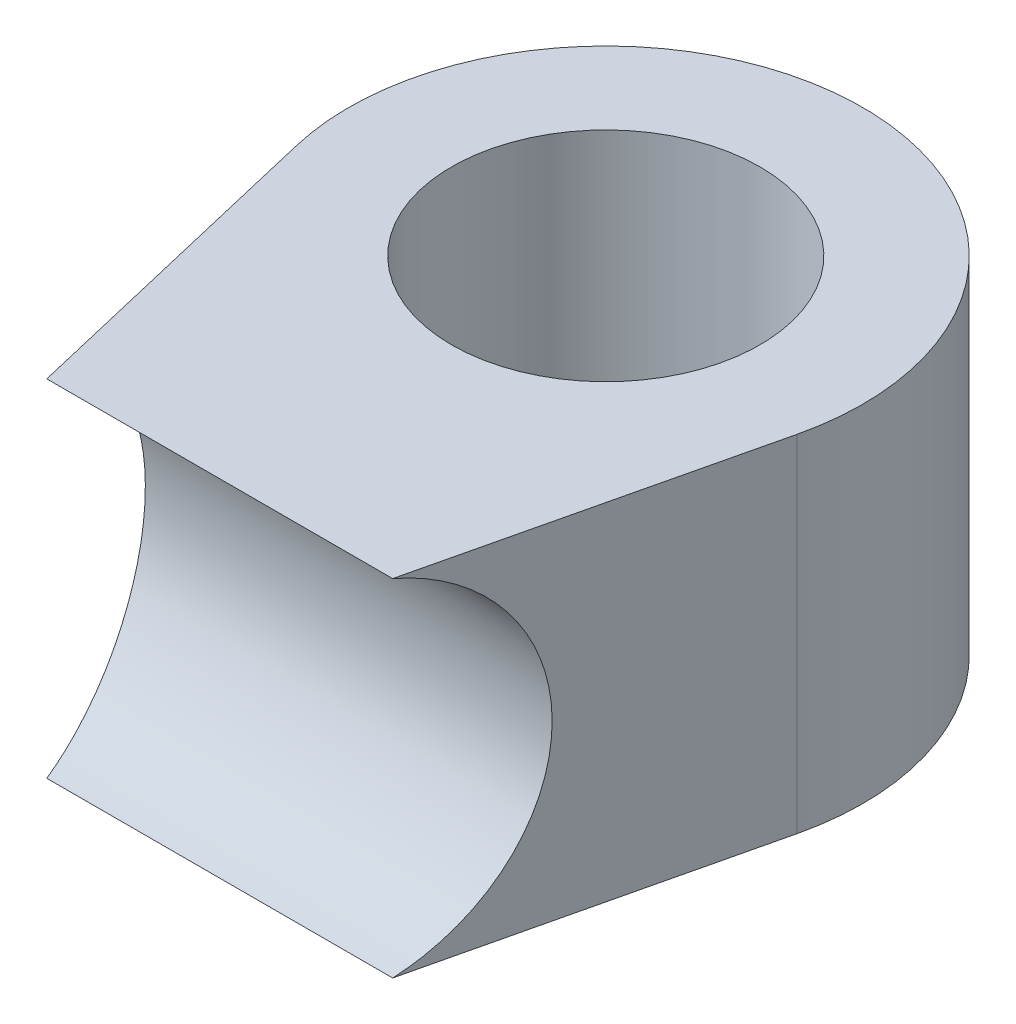
ISO-10303-21;
HEADER;
FILE_DESCRIPTION(('STEP AP214'),'2;1');
FILE_NAME('part.step','',(''),(''),'','','');
FILE_SCHEMA(('AUTOMOTIVE_DESIGN { 1 0 10303 214 1 1 1 1 }'));
ENDSEC;
DATA;
#1=APPLICATION_CONTEXT('core data for automotive mechanical design processes');
#2=APPLICATION_PROTOCOL_DEFINITION('international standard','automotive_design',2000,#1);
#3=PRODUCT_CONTEXT('',#1,'mechanical');
#4=PRODUCT('Part','Part','',(#3));
#5=PRODUCT_RELATED_PRODUCT_CATEGORY('part','',(#4));
#6=PRODUCT_DEFINITION_FORMATION('','',#4);
#7=PRODUCT_DEFINITION_CONTEXT('part definition',#1,'design');
#8=PRODUCT_DEFINITION('design','',#6,#7);
#9=PRODUCT_DEFINITION_SHAPE('','',#8);
#10=(LENGTH_UNIT() NAMED_UNIT(*) SI_UNIT(.MILLI.,.METRE.));
#11=(NAMED_UNIT(*) PLANE_ANGLE_UNIT() SI_UNIT($,.RADIAN.));
#12=(NAMED_UNIT(*) SI_UNIT($,.STERADIAN.) SOLID_ANGLE_UNIT());
#13=UNCERTAINTY_MEASURE_WITH_UNIT(LENGTH_MEASURE(1.E-05),#10,'distance_accuracy_value','');
#14=(GEOMETRIC_REPRESENTATION_CONTEXT(3) GLOBAL_UNCERTAINTY_ASSIGNED_CONTEXT((#13)) GLOBAL_UNIT_ASSIGNED_CONTEXT((#10,
#11,#12)) REPRESENTATION_CONTEXT('',''));
#15=CARTESIAN_POINT('',(0.,0.,0.));
#16=DIRECTION('',(0.,0.,1.));
#17=DIRECTION('',(1.,0.,0.));
#18=AXIS2_PLACEMENT_3D('',#15,#16,#17);
#19=CARTESIAN_POINT('',(2.96331803912152,10.,0.699556302231625));
#20=DIRECTION('',(-0.973248122429371,0.,-0.229756593349797));
#21=DIRECTION('',(-0.229756593349797,0.,0.973248122429371));
#22=AXIS2_PLACEMENT_3D('',#19,#20,#21);
#23=PLANE('',#22);
#24=DIRECTION('',(0.,-1.,0.));
#25=VECTOR('',#24,1.);
#26=CARTESIAN_POINT('',(4.86624061214686,10.,-7.36121703325101));
#27=LINE('',#26,#25);
#28=CARTESIAN_POINT('',(4.86624061214686,6.72907125835356,-7.36121703325101));
#29=VERTEX_POINT('',#28);
#30=CARTESIAN_POINT('',(4.86624061214686,0.,-7.36121703325101));
#31=VERTEX_POINT('',#30);
#32=EDGE_CURVE('E11',#29,#31,#27,.T.);
#33=ORIENTED_EDGE('',*,*,#32,.F.);
#34=DIRECTION('',(-0.229756593349797,0.,0.973248122429371));
#35=VECTOR('',#34,1.);
#36=CARTESIAN_POINT('',(2.96331803912152,6.72907125835356,0.699556302231625));
#37=LINE('',#36,#35);
#38=CARTESIAN_POINT('',(3.36453562917678,6.72907125835356,-1.));
#39=VERTEX_POINT('',#38);
#40=EDGE_CURVE('E84',#29,#39,#37,.T.);
#41=ORIENTED_EDGE('',*,*,#40,.T.);
#42=CARTESIAN_POINT('',(3.12846366761338,3.36453562917678,0.));
#43=DIRECTION('',(-0.973248122429371,0.,-0.229756593349797));
#44=DIRECTION('',(0.229756593349797,0.,-0.973248122429371));
#45=AXIS2_PLACEMENT_3D('',#42,#43,#44);
#46=ELLIPSE('',#45,3.60648011448357,3.51);
#47=CARTESIAN_POINT('',(3.36453562917678,0.,-1.));
#48=VERTEX_POINT('',#47);
#49=EDGE_CURVE('E89',#39,#48,#46,.T.);
#50=ORIENTED_EDGE('',*,*,#49,.T.);
#51=DIRECTION('',(0.229756593349797,0.,-0.973248122429371));
#52=VECTOR('',#51,1.);
#53=CARTESIAN_POINT('',(2.96331803912152,0.,0.699556302231625));
#54=LINE('',#53,#52);
#55=EDGE_CURVE('E88',#48,#31,#54,.T.);
#56=ORIENTED_EDGE('',*,*,#55,.T.);
#57=EDGE_LOOP('',(#33,#41,#50,#56));
#58=FACE_BOUND('',#57,.T.);
#59=ADVANCED_FACE('F42',(#58),#23,.F.);
#60=CARTESIAN_POINT('',(0.,10.,-8.51));
#61=DIRECTION('',(0.,-1.,0.));
#62=DIRECTION('',(0.,0.,-1.));
#63=AXIS2_PLACEMENT_3D('',#60,#61,#62);
#64=CYLINDRICAL_SURFACE('',#63,5.);
#65=DIRECTION('',(0.,-1.,0.));
#66=VECTOR('',#65,1.);
#67=CARTESIAN_POINT('',(-4.86624061214686,10.,-7.36121703325101));
#68=LINE('',#67,#66);
#69=CARTESIAN_POINT('',(-4.86624061214686,6.72907125835356,-7.36121703325101));
#70=VERTEX_POINT('',#69);
#71=CARTESIAN_POINT('',(-4.86624061214686,0.,-7.36121703325101));
#72=VERTEX_POINT('',#71);
#73=EDGE_CURVE('E49',#70,#72,#68,.T.);
#74=ORIENTED_EDGE('',*,*,#73,.F.);
#75=CARTESIAN_POINT('',(0.,6.72907125835356,-8.51));
#76=DIRECTION('',(0.,-1.,0.));
#77=DIRECTION('',(0.,0.,-1.));
#78=AXIS2_PLACEMENT_3D('',#75,#76,#77);
#79=CIRCLE('',#78,5.);
#80=EDGE_CURVE('E96',#70,#29,#79,.T.);
#81=ORIENTED_EDGE('',*,*,#80,.T.);
#82=ORIENTED_EDGE('',*,*,#32,.T.);
#83=CARTESIAN_POINT('',(0.,0.,-8.51));
#84=DIRECTION('',(0.,1.,0.));
#85=DIRECTION('',(0.,0.,1.));
#86=AXIS2_PLACEMENT_3D('',#83,#84,#85);
#87=CIRCLE('',#86,5.);
#88=EDGE_CURVE('E104',#31,#72,#87,.T.);
#89=ORIENTED_EDGE('',*,*,#88,.T.);
#90=EDGE_LOOP('',(#74,#81,#82,#89));
#91=FACE_BOUND('',#90,.T.);
#92=ADVANCED_FACE('F127',(#91),#64,.T.);
#93=CARTESIAN_POINT('',(-2.96331803912152,10.,0.699556302231625));
#94=DIRECTION('',(-0.973248122429371,0.,0.229756593349797));
#95=DIRECTION('',(0.229756593349797,0.,0.973248122429371));
#96=AXIS2_PLACEMENT_3D('',#93,#94,#95);
#97=PLANE('',#96);
#98=DIRECTION('',(0.229756593349797,0.,0.973248122429371));
#99=VECTOR('',#98,1.);
#100=CARTESIAN_POINT('',(-2.96331803912152,6.72907125835356,0.699556302231625));
#101=LINE('',#100,#99);
#102=CARTESIAN_POINT('',(-3.36453562917678,6.72907125835356,-1.));
#103=VERTEX_POINT('',#102);
#104=EDGE_CURVE('E86',#70,#103,#101,.T.);
#105=ORIENTED_EDGE('',*,*,#104,.F.);
#106=ORIENTED_EDGE('',*,*,#73,.T.);
#107=DIRECTION('',(-0.229756593349797,0.,-0.973248122429371));
#108=VECTOR('',#107,1.);
#109=CARTESIAN_POINT('',(-2.96331803912152,0.,0.699556302231625));
#110=LINE('',#109,#108);
#111=CARTESIAN_POINT('',(-3.36453562917678,0.,-1.));
#112=VERTEX_POINT('',#111);
#113=EDGE_CURVE('E106',#112,#72,#110,.T.);
#114=ORIENTED_EDGE('',*,*,#113,.F.);
#115=CARTESIAN_POINT('',(-3.12846366761338,3.36453562917678,0.));
#116=DIRECTION('',(-0.973248122429371,0.,0.229756593349797));
#117=DIRECTION('',(0.229756593349797,0.,0.973248122429371));
#118=AXIS2_PLACEMENT_3D('',#115,#116,#117);
#119=ELLIPSE('',#118,3.60648011448357,3.51);
#120=EDGE_CURVE('E56',#103,#112,#119,.T.);
#121=ORIENTED_EDGE('',*,*,#120,.F.);
#122=EDGE_LOOP('',(#105,#106,#114,#121));
#123=FACE_BOUND('',#122,.T.);
#124=ADVANCED_FACE('F118',(#123),#97,.T.);
#125=CARTESIAN_POINT('',(0.,10.,-8.51));
#126=DIRECTION('',(0.,-1.,0.));
#127=DIRECTION('',(0.,0.,-1.));
#128=AXIS2_PLACEMENT_3D('',#125,#126,#127);
#129=CYLINDRICAL_SURFACE('',#128,3.);
#130=CARTESIAN_POINT('',(0.,6.72907125835356,-8.51));
#131=DIRECTION('',(0.,-1.,0.));
#132=DIRECTION('',(0.,0.,-1.));
#133=AXIS2_PLACEMENT_3D('',#130,#131,#132);
#134=CIRCLE('',#133,3.);
#135=CARTESIAN_POINT('',(0.,6.72907125835356,-11.51));
#136=VERTEX_POINT('',#135);
#137=EDGE_CURVE('E138',#136,#136,#134,.T.);
#138=ORIENTED_EDGE('',*,*,#137,.F.);
#139=EDGE_LOOP('',(#138));
#140=FACE_BOUND('',#139,.T.);
#141=CARTESIAN_POINT('',(0.,0.,-8.51));
#142=DIRECTION('',(0.,1.,0.));
#143=DIRECTION('',(0.,0.,1.));
#144=AXIS2_PLACEMENT_3D('',#141,#142,#143);
#145=CIRCLE('',#144,3.);
#146=CARTESIAN_POINT('',(0.,0.,-5.51));
#147=VERTEX_POINT('',#146);
#148=EDGE_CURVE('E110',#147,#147,#145,.T.);
#149=ORIENTED_EDGE('',*,*,#148,.F.);
#150=EDGE_LOOP('',(#149));
#151=FACE_BOUND('',#150,.T.);
#152=ADVANCED_FACE('F116',(#140,#151),#129,.F.);
#153=CARTESIAN_POINT('',(0.,0.,0.));
#154=DIRECTION('',(0.,1.,0.));
#155=DIRECTION('',(0.,0.,1.));
#156=AXIS2_PLACEMENT_3D('',#153,#154,#155);
#157=PLANE('',#156);
#158=ORIENTED_EDGE('',*,*,#55,.F.);
#159=DIRECTION('',(1.,0.,0.));
#160=VECTOR('',#159,1.);
#161=CARTESIAN_POINT('',(0.,0.,-1.));
#162=LINE('',#161,#160);
#163=EDGE_CURVE('E99',#112,#48,#162,.T.);
#164=ORIENTED_EDGE('',*,*,#163,.F.);
#165=ORIENTED_EDGE('',*,*,#113,.T.);
#166=ORIENTED_EDGE('',*,*,#88,.F.);
#167=EDGE_LOOP('',(#158,#164,#165,#166));
#168=FACE_BOUND('',#167,.T.);
#169=ORIENTED_EDGE('',*,*,#148,.T.);
#170=EDGE_LOOP('',(#169));
#171=FACE_BOUND('',#170,.T.);
#172=ADVANCED_FACE('F114',(#168,#171),#157,.F.);
#173=CARTESIAN_POINT('',(-5.,3.36453562917678,0.));
#174=DIRECTION('',(1.,0.,0.));
#175=DIRECTION('',(0.,0.,-1.));
#176=AXIS2_PLACEMENT_3D('',#173,#174,#175);
#177=CYLINDRICAL_SURFACE('',#176,3.51);
#178=ORIENTED_EDGE('',*,*,#120,.T.);
#179=ORIENTED_EDGE('',*,*,#163,.T.);
#180=ORIENTED_EDGE('',*,*,#49,.F.);
#181=DIRECTION('',(1.,0.,0.));
#182=VECTOR('',#181,1.);
#183=CARTESIAN_POINT('',(-5.,6.72907125835356,-1.));
#184=LINE('',#183,#182);
#185=EDGE_CURVE('E81',#103,#39,#184,.T.);
#186=ORIENTED_EDGE('',*,*,#185,.F.);
#187=EDGE_LOOP('',(#178,#179,#180,#186));
#188=FACE_BOUND('',#187,.T.);
#189=ADVANCED_FACE('F98',(#188),#177,.F.);
#190=CARTESIAN_POINT('',(-10.3819862680409,6.72907125835356,-13.51));
#191=DIRECTION('',(0.,-1.,0.));
#192=DIRECTION('',(0.,0.,-1.));
#193=AXIS2_PLACEMENT_3D('',#190,#191,#192);
#194=PLANE('',#193);
#195=ORIENTED_EDGE('',*,*,#137,.T.);
#196=EDGE_LOOP('',(#195));
#197=FACE_BOUND('',#196,.T.);
#198=ORIENTED_EDGE('',*,*,#80,.F.);
#199=ORIENTED_EDGE('',*,*,#104,.T.);
#200=ORIENTED_EDGE('',*,*,#185,.T.);
#201=ORIENTED_EDGE('',*,*,#40,.F.);
#202=EDGE_LOOP('',(#198,#199,#200,#201));
#203=FACE_BOUND('',#202,.T.);
#204=ADVANCED_FACE('F83',(#197,#203),#194,.F.);
#205=CLOSED_SHELL('',(#59,#92,#124,#152,#172,#189,#204));
#206=MANIFOLD_SOLID_BREP('B2',#205);
#207=ADVANCED_BREP_SHAPE_REPRESENTATION('',(#18,#206),#14);
#208=SHAPE_DEFINITION_REPRESENTATION(#9,#207);
ENDSEC;
END-ISO-10303-21;
